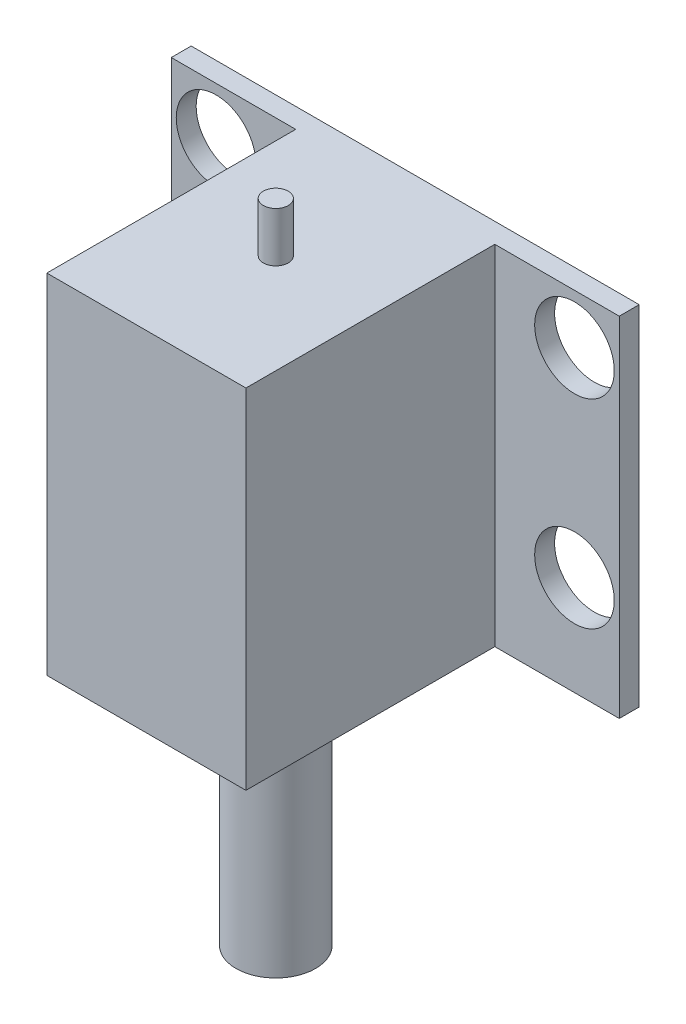
ISO-10303-21;
HEADER;
FILE_DESCRIPTION(('STEP AP214'),'2;1');
FILE_NAME('part.step','',(''),(''),'','','');
FILE_SCHEMA(('AUTOMOTIVE_DESIGN { 1 0 10303 214 1 1 1 1 }'));
ENDSEC;
DATA;
#1=APPLICATION_CONTEXT('core data for automotive mechanical design processes');
#2=APPLICATION_PROTOCOL_DEFINITION('international standard','automotive_design',2000,#1);
#3=PRODUCT_CONTEXT('',#1,'mechanical');
#4=PRODUCT('Part','Part','',(#3));
#5=PRODUCT_RELATED_PRODUCT_CATEGORY('part','',(#4));
#6=PRODUCT_DEFINITION_FORMATION('','',#4);
#7=PRODUCT_DEFINITION_CONTEXT('part definition',#1,'design');
#8=PRODUCT_DEFINITION('design','',#6,#7);
#9=PRODUCT_DEFINITION_SHAPE('','',#8);
#10=(LENGTH_UNIT() NAMED_UNIT(*) SI_UNIT(.MILLI.,.METRE.));
#11=(NAMED_UNIT(*) PLANE_ANGLE_UNIT() SI_UNIT($,.RADIAN.));
#12=(NAMED_UNIT(*) SI_UNIT($,.STERADIAN.) SOLID_ANGLE_UNIT());
#13=UNCERTAINTY_MEASURE_WITH_UNIT(LENGTH_MEASURE(1.E-05),#10,'distance_accuracy_value','');
#14=(GEOMETRIC_REPRESENTATION_CONTEXT(3) GLOBAL_UNCERTAINTY_ASSIGNED_CONTEXT((#13)) GLOBAL_UNIT_ASSIGNED_CONTEXT((#10,
#11,#12)) REPRESENTATION_CONTEXT('',''));
#15=CARTESIAN_POINT('',(0.,0.,0.));
#16=DIRECTION('',(0.,0.,1.));
#17=DIRECTION('',(1.,0.,0.));
#18=AXIS2_PLACEMENT_3D('',#15,#16,#17);
#19=CARTESIAN_POINT('',(0.,0.,2.));
#20=DIRECTION('',(0.,0.,-1.));
#21=DIRECTION('',(-1.,0.,0.));
#22=AXIS2_PLACEMENT_3D('',#19,#20,#21);
#23=PLANE('',#22);
#24=CARTESIAN_POINT('',(-18.,12.5,2.));
#25=DIRECTION('',(0.,0.,-1.));
#26=DIRECTION('',(-1.,0.,0.));
#27=AXIS2_PLACEMENT_3D('',#24,#25,#26);
#28=CIRCLE('',#27,4.);
#29=CARTESIAN_POINT('',(-22.,12.5,2.));
#30=VERTEX_POINT('',#29);
#31=EDGE_CURVE('E169',#30,#30,#28,.T.);
#32=ORIENTED_EDGE('',*,*,#31,.T.);
#33=EDGE_LOOP('',(#32));
#34=FACE_BOUND('',#33,.T.);
#35=CARTESIAN_POINT('',(-18.,-7.5,2.));
#36=DIRECTION('',(0.,0.,-1.));
#37=DIRECTION('',(-1.,0.,0.));
#38=AXIS2_PLACEMENT_3D('',#35,#36,#37);
#39=CIRCLE('',#38,4.);
#40=CARTESIAN_POINT('',(-22.,-7.5,2.));
#41=VERTEX_POINT('',#40);
#42=EDGE_CURVE('E163',#41,#41,#39,.T.);
#43=ORIENTED_EDGE('',*,*,#42,.T.);
#44=EDGE_LOOP('',(#43));
#45=FACE_BOUND('',#44,.T.);
#46=DIRECTION('',(0.,-1.,0.));
#47=VECTOR('',#46,1.);
#48=CARTESIAN_POINT('',(-10.,-17.5,2.));
#49=LINE('',#48,#47);
#50=CARTESIAN_POINT('',(-10.,17.5,2.));
#51=VERTEX_POINT('',#50);
#52=CARTESIAN_POINT('',(-10.,-17.5,2.));
#53=VERTEX_POINT('',#52);
#54=EDGE_CURVE('E120',#51,#53,#49,.T.);
#55=ORIENTED_EDGE('',*,*,#54,.F.);
#56=DIRECTION('',(-1.,0.,0.));
#57=VECTOR('',#56,1.);
#58=CARTESIAN_POINT('',(-22.5,17.5,2.));
#59=LINE('',#58,#57);
#60=CARTESIAN_POINT('',(-22.5,17.5,2.));
#61=VERTEX_POINT('',#60);
#62=EDGE_CURVE('E269',#51,#61,#59,.T.);
#63=ORIENTED_EDGE('',*,*,#62,.T.);
#64=DIRECTION('',(0.,-1.,0.));
#65=VECTOR('',#64,1.);
#66=CARTESIAN_POINT('',(-22.5,-17.5,2.));
#67=LINE('',#66,#65);
#68=CARTESIAN_POINT('',(-22.5,-17.5,2.));
#69=VERTEX_POINT('',#68);
#70=EDGE_CURVE('E254',#61,#69,#67,.T.);
#71=ORIENTED_EDGE('',*,*,#70,.T.);
#72=DIRECTION('',(1.,0.,0.));
#73=VECTOR('',#72,1.);
#74=CARTESIAN_POINT('',(-22.5,-17.5,2.));
#75=LINE('',#74,#73);
#76=EDGE_CURVE('E57',#69,#53,#75,.T.);
#77=ORIENTED_EDGE('',*,*,#76,.T.);
#78=EDGE_LOOP('',(#55,#63,#71,#77));
#79=FACE_BOUND('',#78,.T.);
#80=ADVANCED_FACE('F34',(#34,#45,#79),#23,.F.);
#81=CARTESIAN_POINT('',(18.,-7.50000000000002,2.));
#82=DIRECTION('',(0.,0.,-1.));
#83=DIRECTION('',(-1.,0.,0.));
#84=AXIS2_PLACEMENT_3D('',#81,#82,#83);
#85=CIRCLE('',#84,4.);
#86=CARTESIAN_POINT('',(14.,-7.50000000000002,2.));
#87=VERTEX_POINT('',#86);
#88=EDGE_CURVE('E181',#87,#87,#85,.F.);
#89=ORIENTED_EDGE('',*,*,#88,.F.);
#90=EDGE_LOOP('',(#89));
#91=FACE_BOUND('',#90,.T.);
#92=CARTESIAN_POINT('',(18.,12.5,2.));
#93=DIRECTION('',(0.,0.,-1.));
#94=DIRECTION('',(-1.,0.,0.));
#95=AXIS2_PLACEMENT_3D('',#92,#93,#94);
#96=CIRCLE('',#95,4.);
#97=CARTESIAN_POINT('',(14.,12.5,2.));
#98=VERTEX_POINT('',#97);
#99=EDGE_CURVE('E175',#98,#98,#96,.F.);
#100=ORIENTED_EDGE('',*,*,#99,.F.);
#101=EDGE_LOOP('',(#100));
#102=FACE_BOUND('',#101,.T.);
#103=DIRECTION('',(0.,1.,0.));
#104=VECTOR('',#103,1.);
#105=CARTESIAN_POINT('',(10.,-17.5,2.));
#106=LINE('',#105,#104);
#107=CARTESIAN_POINT('',(9.99999999999997,-17.5,2.));
#108=VERTEX_POINT('',#107);
#109=CARTESIAN_POINT('',(10.,17.5,2.));
#110=VERTEX_POINT('',#109);
#111=EDGE_CURVE('E49',#108,#110,#106,.T.);
#112=ORIENTED_EDGE('',*,*,#111,.F.);
#113=CARTESIAN_POINT('',(22.5,-17.5,2.));
#114=VERTEX_POINT('',#113);
#115=EDGE_CURVE('E149',#108,#114,#75,.T.);
#116=ORIENTED_EDGE('',*,*,#115,.T.);
#117=DIRECTION('',(0.,1.,0.));
#118=VECTOR('',#117,1.);
#119=CARTESIAN_POINT('',(22.5,-17.5,2.));
#120=LINE('',#119,#118);
#121=CARTESIAN_POINT('',(22.5,17.5,2.));
#122=VERTEX_POINT('',#121);
#123=EDGE_CURVE('E144',#114,#122,#120,.T.);
#124=ORIENTED_EDGE('',*,*,#123,.T.);
#125=EDGE_CURVE('E267',#122,#110,#59,.T.);
#126=ORIENTED_EDGE('',*,*,#125,.T.);
#127=EDGE_LOOP('',(#112,#116,#124,#126));
#128=FACE_BOUND('',#127,.T.);
#129=ADVANCED_FACE('F198',(#91,#102,#128),#23,.F.);
#130=CARTESIAN_POINT('',(22.5,-17.5,2.));
#131=DIRECTION('',(-1.,0.,0.));
#132=DIRECTION('',(0.,0.,1.));
#133=AXIS2_PLACEMENT_3D('',#130,#131,#132);
#134=PLANE('',#133);
#135=DIRECTION('',(0.,1.,0.));
#136=VECTOR('',#135,1.);
#137=CARTESIAN_POINT('',(22.5,-17.5,0.));
#138=LINE('',#137,#136);
#139=CARTESIAN_POINT('',(22.5,-17.5,0.));
#140=VERTEX_POINT('',#139);
#141=CARTESIAN_POINT('',(22.5,17.5,0.));
#142=VERTEX_POINT('',#141);
#143=EDGE_CURVE('E121',#140,#142,#138,.T.);
#144=ORIENTED_EDGE('',*,*,#143,.T.);
#145=DIRECTION('',(0.,0.,-1.));
#146=VECTOR('',#145,1.);
#147=CARTESIAN_POINT('',(22.5,17.5,2.));
#148=LINE('',#147,#146);
#149=EDGE_CURVE('E246',#122,#142,#148,.T.);
#150=ORIENTED_EDGE('',*,*,#149,.F.);
#151=ORIENTED_EDGE('',*,*,#123,.F.);
#152=DIRECTION('',(0.,0.,-1.));
#153=VECTOR('',#152,1.);
#154=CARTESIAN_POINT('',(22.5,-17.5,2.));
#155=LINE('',#154,#153);
#156=EDGE_CURVE('E262',#114,#140,#155,.T.);
#157=ORIENTED_EDGE('',*,*,#156,.T.);
#158=EDGE_LOOP('',(#144,#150,#151,#157));
#159=FACE_BOUND('',#158,.T.);
#160=ADVANCED_FACE('F36',(#159),#134,.F.);
#161=CARTESIAN_POINT('',(-22.5,17.5,2.));
#162=DIRECTION('',(0.,-1.,0.));
#163=DIRECTION('',(0.,0.,-1.));
#164=AXIS2_PLACEMENT_3D('',#161,#162,#163);
#165=PLANE('',#164);
#166=CARTESIAN_POINT('',(0.,17.5,14.));
#167=DIRECTION('',(0.,-1.,0.));
#168=DIRECTION('',(0.,0.,-1.));
#169=AXIS2_PLACEMENT_3D('',#166,#167,#168);
#170=CIRCLE('',#169,1.25);
#171=CARTESIAN_POINT('',(0.,17.5,12.75));
#172=VERTEX_POINT('',#171);
#173=EDGE_CURVE('E11',#172,#172,#170,.F.);
#174=ORIENTED_EDGE('',*,*,#173,.F.);
#175=EDGE_LOOP('',(#174));
#176=FACE_BOUND('',#175,.T.);
#177=DIRECTION('',(-1.,0.,0.));
#178=VECTOR('',#177,1.);
#179=CARTESIAN_POINT('',(-22.5,17.5,0.));
#180=LINE('',#179,#178);
#181=CARTESIAN_POINT('',(-22.5,17.5,0.));
#182=VERTEX_POINT('',#181);
#183=EDGE_CURVE('E124',#142,#182,#180,.T.);
#184=ORIENTED_EDGE('',*,*,#183,.T.);
#185=DIRECTION('',(0.,0.,-1.));
#186=VECTOR('',#185,1.);
#187=CARTESIAN_POINT('',(-22.5,17.5,2.));
#188=LINE('',#187,#186);
#189=EDGE_CURVE('E243',#61,#182,#188,.T.);
#190=ORIENTED_EDGE('',*,*,#189,.F.);
#191=ORIENTED_EDGE('',*,*,#62,.F.);
#192=DIRECTION('',(0.,0.,-1.));
#193=VECTOR('',#192,1.);
#194=CARTESIAN_POINT('',(-10.,17.5,27.));
#195=LINE('',#194,#193);
#196=CARTESIAN_POINT('',(-10.,17.5,27.));
#197=VERTEX_POINT('',#196);
#198=EDGE_CURVE('E136',#197,#51,#195,.T.);
#199=ORIENTED_EDGE('',*,*,#198,.F.);
#200=DIRECTION('',(-1.,0.,0.));
#201=VECTOR('',#200,1.);
#202=CARTESIAN_POINT('',(10.,17.5,27.));
#203=LINE('',#202,#201);
#204=CARTESIAN_POINT('',(10.,17.5,27.));
#205=VERTEX_POINT('',#204);
#206=EDGE_CURVE('E114',#205,#197,#203,.T.);
#207=ORIENTED_EDGE('',*,*,#206,.F.);
#208=DIRECTION('',(0.,0.,-1.));
#209=VECTOR('',#208,1.);
#210=CARTESIAN_POINT('',(10.,17.5,27.));
#211=LINE('',#210,#209);
#212=EDGE_CURVE('E126',#205,#110,#211,.T.);
#213=ORIENTED_EDGE('',*,*,#212,.T.);
#214=ORIENTED_EDGE('',*,*,#125,.F.);
#215=ORIENTED_EDGE('',*,*,#149,.T.);
#216=EDGE_LOOP('',(#184,#190,#191,#199,#207,#213,#214,#215));
#217=FACE_BOUND('',#216,.T.);
#218=ADVANCED_FACE('F230',(#176,#217),#165,.F.);
#219=CARTESIAN_POINT('',(-22.5,-17.5,2.));
#220=DIRECTION('',(1.,0.,0.));
#221=DIRECTION('',(0.,0.,-1.));
#222=AXIS2_PLACEMENT_3D('',#219,#220,#221);
#223=PLANE('',#222);
#224=DIRECTION('',(0.,-1.,0.));
#225=VECTOR('',#224,1.);
#226=CARTESIAN_POINT('',(-22.5,-17.5,0.));
#227=LINE('',#226,#225);
#228=CARTESIAN_POINT('',(-22.5,-17.5,0.));
#229=VERTEX_POINT('',#228);
#230=EDGE_CURVE('E250',#182,#229,#227,.T.);
#231=ORIENTED_EDGE('',*,*,#230,.T.);
#232=DIRECTION('',(0.,0.,-1.));
#233=VECTOR('',#232,1.);
#234=CARTESIAN_POINT('',(-22.5,-17.5,2.));
#235=LINE('',#234,#233);
#236=EDGE_CURVE('E255',#69,#229,#235,.T.);
#237=ORIENTED_EDGE('',*,*,#236,.F.);
#238=ORIENTED_EDGE('',*,*,#70,.F.);
#239=ORIENTED_EDGE('',*,*,#189,.T.);
#240=EDGE_LOOP('',(#231,#237,#238,#239));
#241=FACE_BOUND('',#240,.T.);
#242=ADVANCED_FACE('F227',(#241),#223,.F.);
#243=CARTESIAN_POINT('',(-22.5,-17.5,2.));
#244=DIRECTION('',(0.,1.,0.));
#245=DIRECTION('',(0.,0.,1.));
#246=AXIS2_PLACEMENT_3D('',#243,#244,#245);
#247=PLANE('',#246);
#248=CARTESIAN_POINT('',(0.,-17.5,14.));
#249=DIRECTION('',(0.,1.,0.));
#250=DIRECTION('',(0.,0.,1.));
#251=AXIS2_PLACEMENT_3D('',#248,#249,#250);
#252=CIRCLE('',#251,4.);
#253=CARTESIAN_POINT('',(0.,-17.5,18.));
#254=VERTEX_POINT('',#253);
#255=EDGE_CURVE('E42',#254,#254,#252,.F.);
#256=ORIENTED_EDGE('',*,*,#255,.F.);
#257=EDGE_LOOP('',(#256));
#258=FACE_BOUND('',#257,.T.);
#259=DIRECTION('',(1.,0.,0.));
#260=VECTOR('',#259,1.);
#261=CARTESIAN_POINT('',(-22.5,-17.5,0.));
#262=LINE('',#261,#260);
#263=EDGE_CURVE('E258',#229,#140,#262,.T.);
#264=ORIENTED_EDGE('',*,*,#263,.T.);
#265=ORIENTED_EDGE('',*,*,#156,.F.);
#266=ORIENTED_EDGE('',*,*,#115,.F.);
#267=DIRECTION('',(0.,0.,-1.));
#268=VECTOR('',#267,1.);
#269=CARTESIAN_POINT('',(10.,-17.5,27.));
#270=LINE('',#269,#268);
#271=CARTESIAN_POINT('',(10.,-17.5,27.));
#272=VERTEX_POINT('',#271);
#273=EDGE_CURVE('E105',#272,#108,#270,.T.);
#274=ORIENTED_EDGE('',*,*,#273,.F.);
#275=DIRECTION('',(1.,0.,0.));
#276=VECTOR('',#275,1.);
#277=CARTESIAN_POINT('',(10.,-17.5,27.));
#278=LINE('',#277,#276);
#279=CARTESIAN_POINT('',(-10.,-17.5,27.));
#280=VERTEX_POINT('',#279);
#281=EDGE_CURVE('E98',#280,#272,#278,.T.);
#282=ORIENTED_EDGE('',*,*,#281,.F.);
#283=DIRECTION('',(0.,0.,-1.));
#284=VECTOR('',#283,1.);
#285=CARTESIAN_POINT('',(-10.,-17.5,27.));
#286=LINE('',#285,#284);
#287=EDGE_CURVE('E102',#280,#53,#286,.T.);
#288=ORIENTED_EDGE('',*,*,#287,.T.);
#289=ORIENTED_EDGE('',*,*,#76,.F.);
#290=ORIENTED_EDGE('',*,*,#236,.T.);
#291=EDGE_LOOP('',(#264,#265,#266,#274,#282,#288,#289,#290));
#292=FACE_BOUND('',#291,.T.);
#293=ADVANCED_FACE('F100',(#258,#292),#247,.F.);
#294=CARTESIAN_POINT('',(0.,0.,0.));
#295=DIRECTION('',(0.,0.,-1.));
#296=DIRECTION('',(-1.,0.,0.));
#297=AXIS2_PLACEMENT_3D('',#294,#295,#296);
#298=PLANE('',#297);
#299=CARTESIAN_POINT('',(18.,-7.50000000000002,0.));
#300=DIRECTION('',(0.,0.,-1.));
#301=DIRECTION('',(-1.,0.,0.));
#302=AXIS2_PLACEMENT_3D('',#299,#300,#301);
#303=CIRCLE('',#302,4.);
#304=CARTESIAN_POINT('',(14.,-7.50000000000002,0.));
#305=VERTEX_POINT('',#304);
#306=EDGE_CURVE('E184',#305,#305,#303,.F.);
#307=ORIENTED_EDGE('',*,*,#306,.T.);
#308=EDGE_LOOP('',(#307));
#309=FACE_BOUND('',#308,.T.);
#310=CARTESIAN_POINT('',(18.,12.5,0.));
#311=DIRECTION('',(0.,0.,-1.));
#312=DIRECTION('',(-1.,0.,0.));
#313=AXIS2_PLACEMENT_3D('',#310,#311,#312);
#314=CIRCLE('',#313,4.);
#315=CARTESIAN_POINT('',(14.,12.5,0.));
#316=VERTEX_POINT('',#315);
#317=EDGE_CURVE('E178',#316,#316,#314,.F.);
#318=ORIENTED_EDGE('',*,*,#317,.T.);
#319=EDGE_LOOP('',(#318));
#320=FACE_BOUND('',#319,.T.);
#321=CARTESIAN_POINT('',(-18.,12.5,0.));
#322=DIRECTION('',(0.,0.,-1.));
#323=DIRECTION('',(-1.,0.,0.));
#324=AXIS2_PLACEMENT_3D('',#321,#322,#323);
#325=CIRCLE('',#324,4.);
#326=CARTESIAN_POINT('',(-22.,12.5,0.));
#327=VERTEX_POINT('',#326);
#328=EDGE_CURVE('E172',#327,#327,#325,.T.);
#329=ORIENTED_EDGE('',*,*,#328,.F.);
#330=EDGE_LOOP('',(#329));
#331=FACE_BOUND('',#330,.T.);
#332=CARTESIAN_POINT('',(-18.,-7.5,0.));
#333=DIRECTION('',(0.,0.,-1.));
#334=DIRECTION('',(-1.,0.,0.));
#335=AXIS2_PLACEMENT_3D('',#332,#333,#334);
#336=CIRCLE('',#335,4.);
#337=CARTESIAN_POINT('',(-22.,-7.5,0.));
#338=VERTEX_POINT('',#337);
#339=EDGE_CURVE('E166',#338,#338,#336,.T.);
#340=ORIENTED_EDGE('',*,*,#339,.F.);
#341=EDGE_LOOP('',(#340));
#342=FACE_BOUND('',#341,.T.);
#343=ORIENTED_EDGE('',*,*,#143,.F.);
#344=ORIENTED_EDGE('',*,*,#263,.F.);
#345=ORIENTED_EDGE('',*,*,#230,.F.);
#346=ORIENTED_EDGE('',*,*,#183,.F.);
#347=EDGE_LOOP('',(#343,#344,#345,#346));
#348=FACE_BOUND('',#347,.T.);
#349=ADVANCED_FACE('F188',(#309,#320,#331,#342,#348),#298,.T.);
#350=CARTESIAN_POINT('',(-10.,-17.5,27.));
#351=DIRECTION('',(1.,0.,0.));
#352=DIRECTION('',(0.,0.,-1.));
#353=AXIS2_PLACEMENT_3D('',#350,#351,#352);
#354=PLANE('',#353);
#355=ORIENTED_EDGE('',*,*,#54,.T.);
#356=ORIENTED_EDGE('',*,*,#287,.F.);
#357=DIRECTION('',(0.,-1.,0.));
#358=VECTOR('',#357,1.);
#359=CARTESIAN_POINT('',(-10.,-17.5,27.));
#360=LINE('',#359,#358);
#361=EDGE_CURVE('E109',#197,#280,#360,.T.);
#362=ORIENTED_EDGE('',*,*,#361,.F.);
#363=ORIENTED_EDGE('',*,*,#198,.T.);
#364=EDGE_LOOP('',(#355,#356,#362,#363));
#365=FACE_BOUND('',#364,.T.);
#366=ADVANCED_FACE('F119',(#365),#354,.F.);
#367=CARTESIAN_POINT('',(10.,-17.5,27.));
#368=DIRECTION('',(-1.,0.,0.));
#369=DIRECTION('',(0.,0.,1.));
#370=AXIS2_PLACEMENT_3D('',#367,#368,#369);
#371=PLANE('',#370);
#372=ORIENTED_EDGE('',*,*,#111,.T.);
#373=ORIENTED_EDGE('',*,*,#212,.F.);
#374=DIRECTION('',(0.,1.,0.));
#375=VECTOR('',#374,1.);
#376=CARTESIAN_POINT('',(10.,-17.5,27.));
#377=LINE('',#376,#375);
#378=EDGE_CURVE('E108',#272,#205,#377,.T.);
#379=ORIENTED_EDGE('',*,*,#378,.F.);
#380=ORIENTED_EDGE('',*,*,#273,.T.);
#381=EDGE_LOOP('',(#372,#373,#379,#380));
#382=FACE_BOUND('',#381,.T.);
#383=ADVANCED_FACE('F279',(#382),#371,.F.);
#384=CARTESIAN_POINT('',(0.,0.,27.));
#385=DIRECTION('',(0.,0.,1.));
#386=DIRECTION('',(1.,0.,0.));
#387=AXIS2_PLACEMENT_3D('',#384,#385,#386);
#388=PLANE('',#387);
#389=ORIENTED_EDGE('',*,*,#361,.T.);
#390=ORIENTED_EDGE('',*,*,#281,.T.);
#391=ORIENTED_EDGE('',*,*,#378,.T.);
#392=ORIENTED_EDGE('',*,*,#206,.T.);
#393=EDGE_LOOP('',(#389,#390,#391,#392));
#394=FACE_BOUND('',#393,.T.);
#395=ADVANCED_FACE('F112',(#394),#388,.T.);
#396=CARTESIAN_POINT('',(0.,-42.5,14.));
#397=DIRECTION('',(0.,1.,0.));
#398=DIRECTION('',(0.,0.,1.));
#399=AXIS2_PLACEMENT_3D('',#396,#397,#398);
#400=CYLINDRICAL_SURFACE('',#399,4.);
#401=CARTESIAN_POINT('',(0.,-42.5,14.));
#402=DIRECTION('',(0.,-1.,0.));
#403=DIRECTION('',(0.,0.,-1.));
#404=AXIS2_PLACEMENT_3D('',#401,#402,#403);
#405=CIRCLE('',#404,4.);
#406=CARTESIAN_POINT('',(0.,-42.5,10.));
#407=VERTEX_POINT('',#406);
#408=EDGE_CURVE('E135',#407,#407,#405,.T.);
#409=ORIENTED_EDGE('',*,*,#408,.F.);
#410=EDGE_LOOP('',(#409));
#411=FACE_BOUND('',#410,.T.);
#412=ORIENTED_EDGE('',*,*,#255,.T.);
#413=EDGE_LOOP('',(#412));
#414=FACE_BOUND('',#413,.T.);
#415=ADVANCED_FACE('F285',(#411,#414),#400,.T.);
#416=CARTESIAN_POINT('',(0.,-42.5,14.));
#417=DIRECTION('',(0.,-1.,0.));
#418=DIRECTION('',(0.,0.,-1.));
#419=AXIS2_PLACEMENT_3D('',#416,#417,#418);
#420=PLANE('',#419);
#421=ORIENTED_EDGE('',*,*,#408,.T.);
#422=EDGE_LOOP('',(#421));
#423=FACE_BOUND('',#422,.T.);
#424=ADVANCED_FACE('F290',(#423),#420,.T.);
#425=CARTESIAN_POINT('',(0.,22.5,14.));
#426=DIRECTION('',(0.,-1.,0.));
#427=DIRECTION('',(0.,0.,-1.));
#428=AXIS2_PLACEMENT_3D('',#425,#426,#427);
#429=CYLINDRICAL_SURFACE('',#428,1.25);
#430=CARTESIAN_POINT('',(0.,22.5,14.));
#431=DIRECTION('',(0.,1.,0.));
#432=DIRECTION('',(0.,0.,1.));
#433=AXIS2_PLACEMENT_3D('',#430,#431,#432);
#434=CIRCLE('',#433,1.25);
#435=CARTESIAN_POINT('',(0.,22.5,15.25));
#436=VERTEX_POINT('',#435);
#437=EDGE_CURVE('E160',#436,#436,#434,.T.);
#438=ORIENTED_EDGE('',*,*,#437,.F.);
#439=EDGE_LOOP('',(#438));
#440=FACE_BOUND('',#439,.T.);
#441=ORIENTED_EDGE('',*,*,#173,.T.);
#442=EDGE_LOOP('',(#441));
#443=FACE_BOUND('',#442,.T.);
#444=ADVANCED_FACE('F294',(#440,#443),#429,.T.);
#445=CARTESIAN_POINT('',(0.,22.5,14.));
#446=DIRECTION('',(0.,1.,0.));
#447=DIRECTION('',(0.,0.,1.));
#448=AXIS2_PLACEMENT_3D('',#445,#446,#447);
#449=PLANE('',#448);
#450=ORIENTED_EDGE('',*,*,#437,.T.);
#451=EDGE_LOOP('',(#450));
#452=FACE_BOUND('',#451,.T.);
#453=ADVANCED_FACE('F298',(#452),#449,.T.);
#454=CARTESIAN_POINT('',(-18.,-7.5,27.000025));
#455=DIRECTION('',(0.,0.,-1.));
#456=DIRECTION('',(-1.,0.,0.));
#457=AXIS2_PLACEMENT_3D('',#454,#455,#456);
#458=CYLINDRICAL_SURFACE('',#457,4.);
#459=ORIENTED_EDGE('',*,*,#339,.T.);
#460=EDGE_LOOP('',(#459));
#461=FACE_BOUND('',#460,.T.);
#462=ORIENTED_EDGE('',*,*,#42,.F.);
#463=EDGE_LOOP('',(#462));
#464=FACE_BOUND('',#463,.T.);
#465=ADVANCED_FACE('F211',(#461,#464),#458,.F.);
#466=CARTESIAN_POINT('',(-18.,12.5,27.000025));
#467=DIRECTION('',(0.,0.,-1.));
#468=DIRECTION('',(-1.,0.,0.));
#469=AXIS2_PLACEMENT_3D('',#466,#467,#468);
#470=CYLINDRICAL_SURFACE('',#469,4.);
#471=ORIENTED_EDGE('',*,*,#328,.T.);
#472=EDGE_LOOP('',(#471));
#473=FACE_BOUND('',#472,.T.);
#474=ORIENTED_EDGE('',*,*,#31,.F.);
#475=EDGE_LOOP('',(#474));
#476=FACE_BOUND('',#475,.T.);
#477=ADVANCED_FACE('F205',(#473,#476),#470,.F.);
#478=CARTESIAN_POINT('',(18.,12.5,27.000025));
#479=DIRECTION('',(0.,0.,-1.));
#480=DIRECTION('',(-1.,0.,0.));
#481=AXIS2_PLACEMENT_3D('',#478,#479,#480);
#482=CYLINDRICAL_SURFACE('',#481,4.);
#483=ORIENTED_EDGE('',*,*,#317,.F.);
#484=EDGE_LOOP('',(#483));
#485=FACE_BOUND('',#484,.T.);
#486=ORIENTED_EDGE('',*,*,#99,.T.);
#487=EDGE_LOOP('',(#486));
#488=FACE_BOUND('',#487,.T.);
#489=ADVANCED_FACE('F194',(#485,#488),#482,.F.);
#490=CARTESIAN_POINT('',(18.,-7.50000000000002,27.000025));
#491=DIRECTION('',(0.,0.,-1.));
#492=DIRECTION('',(-1.,0.,0.));
#493=AXIS2_PLACEMENT_3D('',#490,#491,#492);
#494=CYLINDRICAL_SURFACE('',#493,4.);
#495=ORIENTED_EDGE('',*,*,#306,.F.);
#496=EDGE_LOOP('',(#495));
#497=FACE_BOUND('',#496,.T.);
#498=ORIENTED_EDGE('',*,*,#88,.T.);
#499=EDGE_LOOP('',(#498));
#500=FACE_BOUND('',#499,.T.);
#501=ADVANCED_FACE('F191',(#497,#500),#494,.F.);
#502=CLOSED_SHELL('',(#80,#129,#160,#218,#242,#293,#349,#366,#383,#395,#415,#424,#444,#453,#465,
#477,#489,#501));
#503=MANIFOLD_SOLID_BREP('B2',#502);
#504=ADVANCED_BREP_SHAPE_REPRESENTATION('',(#18,#503),#14);
#505=SHAPE_DEFINITION_REPRESENTATION(#9,#504);
ENDSEC;
END-ISO-10303-21;
